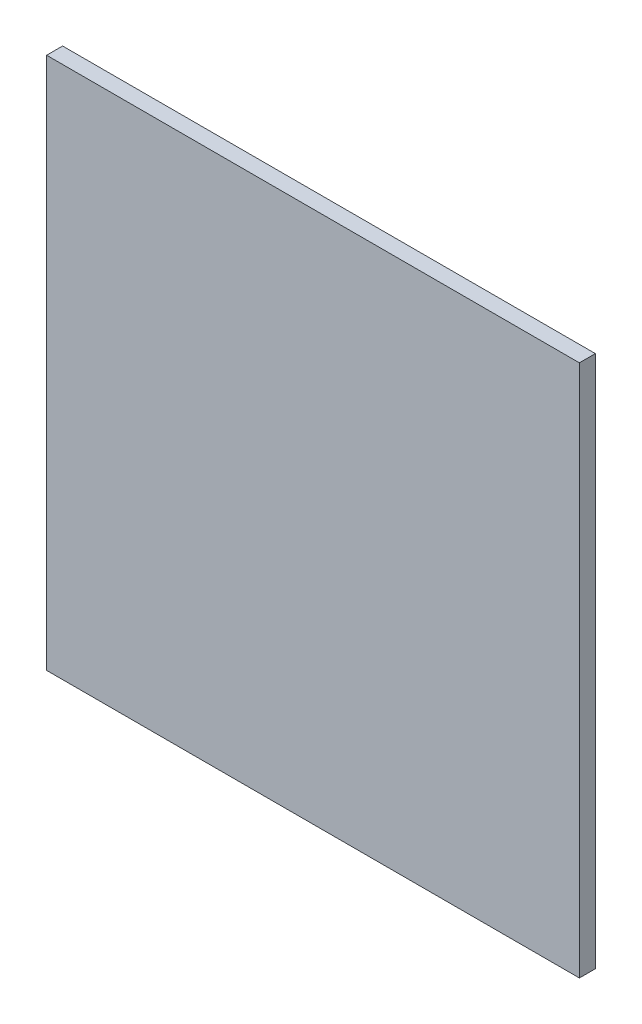
ISO-10303-21;
HEADER;
FILE_DESCRIPTION(('STEP AP214'),'2;1');
FILE_NAME('part.step','',(''),(''),'','','');
FILE_SCHEMA(('AUTOMOTIVE_DESIGN { 1 0 10303 214 1 1 1 1 }'));
ENDSEC;
DATA;
#1=APPLICATION_CONTEXT('core data for automotive mechanical design processes');
#2=APPLICATION_PROTOCOL_DEFINITION('international standard','automotive_design',2000,#1);
#3=PRODUCT_CONTEXT('',#1,'mechanical');
#4=PRODUCT('Part','Part','',(#3));
#5=PRODUCT_RELATED_PRODUCT_CATEGORY('part','',(#4));
#6=PRODUCT_DEFINITION_FORMATION('','',#4);
#7=PRODUCT_DEFINITION_CONTEXT('part definition',#1,'design');
#8=PRODUCT_DEFINITION('design','',#6,#7);
#9=PRODUCT_DEFINITION_SHAPE('','',#8);
#10=(LENGTH_UNIT() NAMED_UNIT(*) SI_UNIT(.MILLI.,.METRE.));
#11=(NAMED_UNIT(*) PLANE_ANGLE_UNIT() SI_UNIT($,.RADIAN.));
#12=(NAMED_UNIT(*) SI_UNIT($,.STERADIAN.) SOLID_ANGLE_UNIT());
#13=UNCERTAINTY_MEASURE_WITH_UNIT(LENGTH_MEASURE(1.E-05),#10,'distance_accuracy_value','');
#14=(GEOMETRIC_REPRESENTATION_CONTEXT(3) GLOBAL_UNCERTAINTY_ASSIGNED_CONTEXT((#13)) GLOBAL_UNIT_ASSIGNED_CONTEXT((#10,
#11,#12)) REPRESENTATION_CONTEXT('',''));
#15=CARTESIAN_POINT('',(0.,0.,0.));
#16=DIRECTION('',(0.,0.,1.));
#17=DIRECTION('',(1.,0.,0.));
#18=AXIS2_PLACEMENT_3D('',#15,#16,#17);
#19=CARTESIAN_POINT('',(0.,0.,3.));
#20=DIRECTION('',(1.,0.,0.));
#21=DIRECTION('',(0.,1.,0.));
#22=AXIS2_PLACEMENT_3D('',#19,#20,#21);
#23=PLANE('',#22);
#24=DIRECTION('',(0.,-1.,0.));
#25=VECTOR('',#24,1.);
#26=CARTESIAN_POINT('',(0.,0.,0.));
#27=LINE('',#26,#25);
#28=CARTESIAN_POINT('',(0.,0.,0.));
#29=VERTEX_POINT('',#28);
#30=CARTESIAN_POINT('',(0.,-100.,0.));
#31=VERTEX_POINT('',#30);
#32=EDGE_CURVE('E96',#29,#31,#27,.T.);
#33=ORIENTED_EDGE('',*,*,#32,.T.);
#34=DIRECTION('',(0.,0.,-1.));
#35=VECTOR('',#34,1.);
#36=CARTESIAN_POINT('',(0.,-100.,3.));
#37=LINE('',#36,#35);
#38=CARTESIAN_POINT('',(0.,-100.,3.));
#39=VERTEX_POINT('',#38);
#40=EDGE_CURVE('E11',#39,#31,#37,.T.);
#41=ORIENTED_EDGE('',*,*,#40,.F.);
#42=DIRECTION('',(0.,-1.,0.));
#43=VECTOR('',#42,1.);
#44=CARTESIAN_POINT('',(0.,0.,3.));
#45=LINE('',#44,#43);
#46=CARTESIAN_POINT('',(0.,0.,3.));
#47=VERTEX_POINT('',#46);
#48=EDGE_CURVE('E84',#47,#39,#45,.T.);
#49=ORIENTED_EDGE('',*,*,#48,.F.);
#50=DIRECTION('',(0.,0.,-1.));
#51=VECTOR('',#50,1.);
#52=CARTESIAN_POINT('',(0.,0.,3.));
#53=LINE('',#52,#51);
#54=EDGE_CURVE('E92',#47,#29,#53,.T.);
#55=ORIENTED_EDGE('',*,*,#54,.T.);
#56=EDGE_LOOP('',(#33,#41,#49,#55));
#57=FACE_BOUND('',#56,.T.);
#58=ADVANCED_FACE('F33',(#57),#23,.F.);
#59=CARTESIAN_POINT('',(0.,-100.,3.));
#60=DIRECTION('',(0.,1.,0.));
#61=DIRECTION('',(0.,0.,1.));
#62=AXIS2_PLACEMENT_3D('',#59,#60,#61);
#63=PLANE('',#62);
#64=DIRECTION('',(1.,0.,0.));
#65=VECTOR('',#64,1.);
#66=CARTESIAN_POINT('',(0.,-100.,0.));
#67=LINE('',#66,#65);
#68=CARTESIAN_POINT('',(100.,-100.,0.));
#69=VERTEX_POINT('',#68);
#70=EDGE_CURVE('E88',#31,#69,#67,.T.);
#71=ORIENTED_EDGE('',*,*,#70,.T.);
#72=DIRECTION('',(0.,0.,-1.));
#73=VECTOR('',#72,1.);
#74=CARTESIAN_POINT('',(100.,-100.,3.));
#75=LINE('',#74,#73);
#76=CARTESIAN_POINT('',(100.,-100.,3.));
#77=VERTEX_POINT('',#76);
#78=EDGE_CURVE('E41',#77,#69,#75,.T.);
#79=ORIENTED_EDGE('',*,*,#78,.F.);
#80=DIRECTION('',(1.,0.,0.));
#81=VECTOR('',#80,1.);
#82=CARTESIAN_POINT('',(0.,-100.,3.));
#83=LINE('',#82,#81);
#84=EDGE_CURVE('E79',#39,#77,#83,.T.);
#85=ORIENTED_EDGE('',*,*,#84,.F.);
#86=ORIENTED_EDGE('',*,*,#40,.T.);
#87=EDGE_LOOP('',(#71,#79,#85,#86));
#88=FACE_BOUND('',#87,.T.);
#89=ADVANCED_FACE('F87',(#88),#63,.F.);
#90=CARTESIAN_POINT('',(100.,0.,3.));
#91=DIRECTION('',(-1.,0.,0.));
#92=DIRECTION('',(0.,-1.,0.));
#93=AXIS2_PLACEMENT_3D('',#90,#91,#92);
#94=PLANE('',#93);
#95=DIRECTION('',(0.,1.,0.));
#96=VECTOR('',#95,1.);
#97=CARTESIAN_POINT('',(100.,0.,0.));
#98=LINE('',#97,#96);
#99=CARTESIAN_POINT('',(100.,0.,0.));
#100=VERTEX_POINT('',#99);
#101=EDGE_CURVE('E66',#69,#100,#98,.T.);
#102=ORIENTED_EDGE('',*,*,#101,.T.);
#103=DIRECTION('',(0.,0.,-1.));
#104=VECTOR('',#103,1.);
#105=CARTESIAN_POINT('',(100.,0.,3.));
#106=LINE('',#105,#104);
#107=CARTESIAN_POINT('',(100.,0.,3.));
#108=VERTEX_POINT('',#107);
#109=EDGE_CURVE('E89',#108,#100,#106,.T.);
#110=ORIENTED_EDGE('',*,*,#109,.F.);
#111=DIRECTION('',(0.,1.,0.));
#112=VECTOR('',#111,1.);
#113=CARTESIAN_POINT('',(100.,0.,3.));
#114=LINE('',#113,#112);
#115=EDGE_CURVE('E82',#77,#108,#114,.T.);
#116=ORIENTED_EDGE('',*,*,#115,.F.);
#117=ORIENTED_EDGE('',*,*,#78,.T.);
#118=EDGE_LOOP('',(#102,#110,#116,#117));
#119=FACE_BOUND('',#118,.T.);
#120=ADVANCED_FACE('F90',(#119),#94,.F.);
#121=CARTESIAN_POINT('',(0.,0.,3.));
#122=DIRECTION('',(0.,-1.,0.));
#123=DIRECTION('',(0.,0.,-1.));
#124=AXIS2_PLACEMENT_3D('',#121,#122,#123);
#125=PLANE('',#124);
#126=DIRECTION('',(-1.,0.,0.));
#127=VECTOR('',#126,1.);
#128=CARTESIAN_POINT('',(0.,0.,0.));
#129=LINE('',#128,#127);
#130=EDGE_CURVE('E72',#100,#29,#129,.T.);
#131=ORIENTED_EDGE('',*,*,#130,.T.);
#132=ORIENTED_EDGE('',*,*,#54,.F.);
#133=DIRECTION('',(-1.,0.,0.));
#134=VECTOR('',#133,1.);
#135=CARTESIAN_POINT('',(0.,0.,3.));
#136=LINE('',#135,#134);
#137=EDGE_CURVE('E49',#108,#47,#136,.T.);
#138=ORIENTED_EDGE('',*,*,#137,.F.);
#139=ORIENTED_EDGE('',*,*,#109,.T.);
#140=EDGE_LOOP('',(#131,#132,#138,#139));
#141=FACE_BOUND('',#140,.T.);
#142=ADVANCED_FACE('F103',(#141),#125,.F.);
#143=CARTESIAN_POINT('',(0.,0.,3.));
#144=DIRECTION('',(0.,0.,1.));
#145=DIRECTION('',(1.,0.,0.));
#146=AXIS2_PLACEMENT_3D('',#143,#144,#145);
#147=PLANE('',#146);
#148=ORIENTED_EDGE('',*,*,#48,.T.);
#149=ORIENTED_EDGE('',*,*,#84,.T.);
#150=ORIENTED_EDGE('',*,*,#115,.T.);
#151=ORIENTED_EDGE('',*,*,#137,.T.);
#152=EDGE_LOOP('',(#148,#149,#150,#151));
#153=FACE_BOUND('',#152,.T.);
#154=ADVANCED_FACE('F80',(#153),#147,.T.);
#155=CARTESIAN_POINT('',(0.,0.,0.));
#156=DIRECTION('',(0.,0.,1.));
#157=DIRECTION('',(1.,0.,0.));
#158=AXIS2_PLACEMENT_3D('',#155,#156,#157);
#159=PLANE('',#158);
#160=ORIENTED_EDGE('',*,*,#32,.F.);
#161=ORIENTED_EDGE('',*,*,#130,.F.);
#162=ORIENTED_EDGE('',*,*,#101,.F.);
#163=ORIENTED_EDGE('',*,*,#70,.F.);
#164=EDGE_LOOP('',(#160,#161,#162,#163));
#165=FACE_BOUND('',#164,.T.);
#166=ADVANCED_FACE('F106',(#165),#159,.F.);
#167=CLOSED_SHELL('',(#58,#89,#120,#142,#154,#166));
#168=MANIFOLD_SOLID_BREP('B2',#167);
#169=ADVANCED_BREP_SHAPE_REPRESENTATION('',(#18,#168),#14);
#170=SHAPE_DEFINITION_REPRESENTATION(#9,#169);
ENDSEC;
END-ISO-10303-21;
